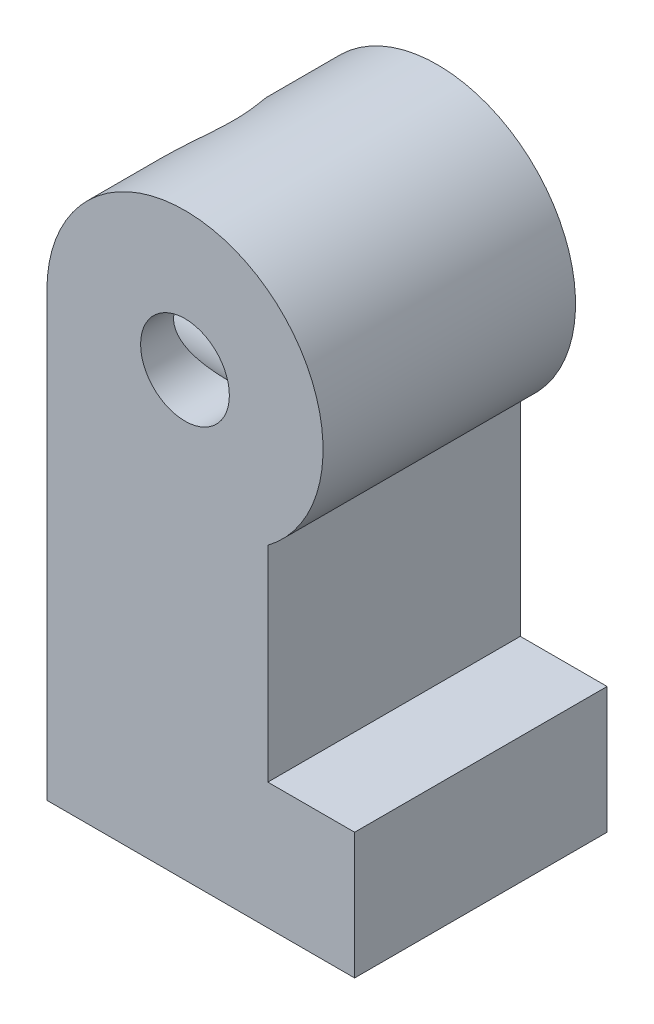
ISO-10303-21;
HEADER;
FILE_DESCRIPTION(('STEP AP214'),'2;1');
FILE_NAME('part.step','',(''),(''),'','','');
FILE_SCHEMA(('AUTOMOTIVE_DESIGN { 1 0 10303 214 1 1 1 1 }'));
ENDSEC;
DATA;
#1=APPLICATION_CONTEXT('core data for automotive mechanical design processes');
#2=APPLICATION_PROTOCOL_DEFINITION('international standard','automotive_design',2000,#1);
#3=PRODUCT_CONTEXT('',#1,'mechanical');
#4=PRODUCT('Part','Part','',(#3));
#5=PRODUCT_RELATED_PRODUCT_CATEGORY('part','',(#4));
#6=PRODUCT_DEFINITION_FORMATION('','',#4);
#7=PRODUCT_DEFINITION_CONTEXT('part definition',#1,'design');
#8=PRODUCT_DEFINITION('design','',#6,#7);
#9=PRODUCT_DEFINITION_SHAPE('','',#8);
#10=(LENGTH_UNIT() NAMED_UNIT(*) SI_UNIT(.MILLI.,.METRE.));
#11=(NAMED_UNIT(*) PLANE_ANGLE_UNIT() SI_UNIT($,.RADIAN.));
#12=(NAMED_UNIT(*) SI_UNIT($,.STERADIAN.) SOLID_ANGLE_UNIT());
#13=UNCERTAINTY_MEASURE_WITH_UNIT(LENGTH_MEASURE(1.E-05),#10,'distance_accuracy_value','');
#14=(GEOMETRIC_REPRESENTATION_CONTEXT(3) GLOBAL_UNCERTAINTY_ASSIGNED_CONTEXT((#13)) GLOBAL_UNIT_ASSIGNED_CONTEXT((#10,
#11,#12)) REPRESENTATION_CONTEXT('',''));
#15=CARTESIAN_POINT('',(0.,0.,0.));
#16=DIRECTION('',(0.,0.,1.));
#17=DIRECTION('',(1.,0.,0.));
#18=AXIS2_PLACEMENT_3D('',#15,#16,#17);
#19=CARTESIAN_POINT('',(0.,0.,3.2));
#20=DIRECTION('',(0.,0.,-1.));
#21=DIRECTION('',(-1.,0.,0.));
#22=AXIS2_PLACEMENT_3D('',#19,#20,#21);
#23=CYLINDRICAL_SURFACE('',#22,1.125);
#24=CARTESIAN_POINT('',(-1.125,0.,2.3473389188611));
#25=CARTESIAN_POINT('',(-1.12499601220494,-0.0635224394016925,2.33380410602163));
#26=CARTESIAN_POINT('',(-1.11959132494664,-0.126549212922416,2.31765742562919));
#27=CARTESIAN_POINT('',(-1.09874390966938,-0.249600832497359,2.28084354065195));
#28=CARTESIAN_POINT('',(-1.08328080509446,-0.309619317884162,2.2601672163323));
#29=CARTESIAN_POINT('',(-1.04347399628676,-0.424828872467446,2.21551034200095));
#30=CARTESIAN_POINT('',(-1.01918406757623,-0.480046716159964,2.19155033632218));
#31=CARTESIAN_POINT('',(-0.962692007757892,-0.585160880286582,2.14145296258323));
#32=CARTESIAN_POINT('',(-0.93048842708919,-0.635056223382687,2.11531519619826));
#33=CARTESIAN_POINT('',(-0.855043059532689,-0.734038070956846,2.05930168968676));
#34=CARTESIAN_POINT('',(-0.810981194410659,-0.782444986465048,2.02932882184068));
#35=CARTESIAN_POINT('',(-0.714751811530277,-0.871229346736284,1.9704227391338));
#36=CARTESIAN_POINT('',(-0.662583608240194,-0.911606111751575,1.94148961245621));
#37=CARTESIAN_POINT('',(-0.560553620351539,-0.976931449596659,1.89210040798983));
#38=CARTESIAN_POINT('',(-0.511920232726052,-1.00334600628982,1.87105058528707));
#39=CARTESIAN_POINT('',(-0.409898900714721,-1.04915235560954,1.83330546508652));
#40=CARTESIAN_POINT('',(-0.356519689306091,-1.06855672780248,1.81660238271409));
#41=CARTESIAN_POINT('',(-0.255688273838734,-1.09657707588453,1.79199009466162));
#42=CARTESIAN_POINT('',(-0.208854174591178,-1.10649312182993,1.78304880822915));
#43=CARTESIAN_POINT('',(-0.113607868283373,-1.12027993373593,1.77053187067493));
#44=CARTESIAN_POINT('',(-0.0651971314711267,-1.12415617597144,1.76695135906744));
#45=CARTESIAN_POINT('',(0.0318951164141843,-1.12559736259209,1.7656258787011));
#46=CARTESIAN_POINT('',(0.0805769707012727,-1.12315004002763,1.76789225217767));
#47=CARTESIAN_POINT('',(0.176650195127621,-1.1120980870853,1.77797429241531));
#48=CARTESIAN_POINT('',(0.224040733843313,-1.10348958268713,1.78579345062547));
#49=CARTESIAN_POINT('',(0.315792323208193,-1.08079074424583,1.80591351695063));
#50=CARTESIAN_POINT('',(0.360183988009273,-1.06677074342543,1.81815679945743));
#51=CARTESIAN_POINT('',(0.445984979510318,-1.03384621377959,1.84601766252827));
#52=CARTESIAN_POINT('',(0.487392080705541,-1.01493808723141,1.8616377270542));
#53=CARTESIAN_POINT('',(0.586599865912948,-0.962317132004969,1.90348152483538));
#54=CARTESIAN_POINT('',(0.642378688916696,-0.925907494659782,1.93112856281814));
#55=CARTESIAN_POINT('',(0.746095583744675,-0.844583744889322,1.98861356265343));
#56=CARTESIAN_POINT('',(0.794020432403516,-0.799655559157647,2.01845509932831));
#57=CARTESIAN_POINT('',(0.881881474375551,-0.701628278219067,2.07832162046633));
#58=CARTESIAN_POINT('',(0.921729872000756,-0.648449443628671,2.10834530791607));
#59=CARTESIAN_POINT('',(0.991845060840207,-0.535075368312611,2.16625635870807));
#60=CARTESIAN_POINT('',(1.02211661777415,-0.47488363788133,2.19414477936842));
#61=CARTESIAN_POINT('',(1.07220537898772,-0.347500994167197,2.24645375260998));
#62=CARTESIAN_POINT('',(1.09184102179963,-0.280210621641525,2.2708091772563));
#63=CARTESIAN_POINT('',(1.11830129387536,-0.141418348366685,2.31383596961299));
#64=CARTESIAN_POINT('',(1.12514078209549,-0.069921431954022,2.33251390890241));
#65=CARTESIAN_POINT('',(1.12487419937618,0.0645909919671675,2.36103577030789));
#66=CARTESIAN_POINT('',(1.11954630491613,0.127430194514606,2.37173815491701));
#67=CARTESIAN_POINT('',(1.09823833796243,0.251952573435595,2.38797131722881));
#68=CARTESIAN_POINT('',(1.08226344227078,0.313636296650123,2.39350460511933));
#69=CARTESIAN_POINT('',(1.04186917954401,0.428381245080361,2.39956020324518));
#70=CARTESIAN_POINT('',(1.01830383740582,0.481726035358663,2.40047602490607));
#71=CARTESIAN_POINT('',(0.963241592460272,0.58409651525199,2.39907264064777));
#72=CARTESIAN_POINT('',(0.93174411250854,0.633121890234734,2.39675319927425));
#73=CARTESIAN_POINT('',(0.860808847831994,0.726751619637444,2.38973742781581));
#74=CARTESIAN_POINT('',(0.82119562079092,0.771218432870854,2.38498432298786));
#75=CARTESIAN_POINT('',(0.735549334158844,0.853295385717144,2.37421545143315));
#76=CARTESIAN_POINT('',(0.689514084025955,0.890903175585667,2.36819925351225));
#77=CARTESIAN_POINT('',(0.589233460463158,0.960398181339222,2.35570701633602));
#78=CARTESIAN_POINT('',(0.534664337344831,0.991818425018867,2.34922475312853));
#79=CARTESIAN_POINT('',(0.420947467673174,1.04516613018686,2.337422559599));
#80=CARTESIAN_POINT('',(0.361799817892581,1.06709379224793,2.33210260471924));
#81=CARTESIAN_POINT('',(0.240144994687219,1.10089203950986,2.3236260336266));
#82=CARTESIAN_POINT('',(0.177619579951596,1.11270065973476,2.32048276876123));
#83=CARTESIAN_POINT('',(0.0514026269180644,1.12561317651157,2.31703583949103));
#84=CARTESIAN_POINT('',(-0.0122886330395961,1.12671959561246,2.31673150594003));
#85=CARTESIAN_POINT('',(-0.136846225401287,1.11833337834389,2.31898238684073));
#86=CARTESIAN_POINT('',(-0.197737514903278,1.10918061955866,2.32144591082964));
#87=CARTESIAN_POINT('',(-0.317092536763579,1.08112758209993,2.32862574389176));
#88=CARTESIAN_POINT('',(-0.375555930246,1.06222594762577,2.3333423663023));
#89=CARTESIAN_POINT('',(-0.489031036023153,1.01502938088974,2.34421265125779));
#90=CARTESIAN_POINT('',(-0.544006889052981,0.986651322218796,2.35037888270572));
#91=CARTESIAN_POINT('',(-0.648564957935641,0.921298464922231,2.3629667637851));
#92=CARTESIAN_POINT('',(-0.698146014087716,0.884321823227384,2.36938846793105));
#93=CARTESIAN_POINT('',(-0.792049197139993,0.801448495023469,2.38137151256474));
#94=CARTESIAN_POINT('',(-0.836169878729182,0.755318256720698,2.3869014056677));
#95=CARTESIAN_POINT('',(-0.916082363289536,0.656103749837208,2.39543400008034));
#96=CARTESIAN_POINT('',(-0.951874490212227,0.603019751858889,2.39843679969698));
#97=CARTESIAN_POINT('',(-1.01310943085238,0.493037399677432,2.40060221734877));
#98=CARTESIAN_POINT('',(-1.03881244804715,0.436286234814305,2.39986933949241));
#99=CARTESIAN_POINT('',(-1.08042458535055,0.319580441437188,2.39391820098744));
#100=CARTESIAN_POINT('',(-1.09634979715911,0.259631253753111,2.38870734402285));
#101=CARTESIAN_POINT('',(-1.11318425741354,0.166074578890811,2.37689171462176));
#102=CARTESIAN_POINT('',(-1.11762785686126,0.132841986110212,2.37198891838182));
#103=CARTESIAN_POINT('',(-1.12353657837511,0.0663613633497973,2.36074018061545));
#104=CARTESIAN_POINT('',(-1.12500207878032,0.0331133358676711,2.35439442251746));
#105=CARTESIAN_POINT('',(-1.125,0.,2.3473389188611));
#106=B_SPLINE_CURVE_WITH_KNOTS('',3,(#24,#25,#26,#27,#28,#29,#30,#31,#32,#33,#34,#35,#36,#37,
#38,#39,#40,#41,#42,#43,#44,#45,#46,#47,#48,#49,#50,#51,#52,#53,#54,#55,#56,#57,#58,#59,#60,#61,
#62,#63,#64,#65,#66,#67,#68,#69,#70,#71,#72,#73,#74,#75,#76,#77,#78,#79,#80,#81,#82,#83,#84,#85,
#86,#87,#88,#89,#90,#91,#92,#93,#94,#95,#96,#97,#98,#99,#100,#101,#102,#103,#104,#105),
.UNSPECIFIED.,.T.,.F.,(4,2,2,2,2,2,2,2,2,2,2,2,2,2,2,2,2,2,2,2,2,2,2,2,2,2,2,2,2,2,2,2,2,2,2,2,
2,2,2,2,4),(0.,0.194704281815476,0.389804233313693,0.583734978458754,0.777701272834722,
0.99278695950388,1.20789084531384,1.3848913370292,1.56157261020517,1.70705132882171,
1.85239806533272,1.9980269684926,2.14374752055163,2.28763466628538,2.43162801780203,
2.64684483394785,2.86242035298069,3.08022658115349,3.29792425138072,3.5192295774167,
3.74027776276115,3.93111548331707,4.12186048207796,4.29603714981357,4.4702264943513,
4.64867833784131,4.82719120048586,5.0162107505443,5.20522630653464,5.39539121189372,
5.58551129357834,5.76951429100895,5.95354288510192,6.13923013043181,6.32495721376973,
6.51623476710657,6.70750487917423,6.89345415453825,7.07909658015413,7.18060602411877,
7.28210257147048),.UNSPECIFIED.);
#107=CARTESIAN_POINT('',(-1.125,0.,2.3473389188611));
#108=VERTEX_POINT('',#107);
#109=EDGE_CURVE('E43',#108,#108,#106,.T.);
#110=ORIENTED_EDGE('',*,*,#109,.F.);
#111=EDGE_LOOP('',(#110));
#112=FACE_BOUND('',#111,.T.);
#113=CARTESIAN_POINT('',(0.,0.,3.2));
#114=DIRECTION('',(0.,0.,1.));
#115=DIRECTION('',(1.,0.,0.));
#116=AXIS2_PLACEMENT_3D('',#113,#114,#115);
#117=CIRCLE('',#116,1.125);
#118=CARTESIAN_POINT('',(1.125,0.,3.2));
#119=VERTEX_POINT('',#118);
#120=EDGE_CURVE('E172',#119,#119,#117,.T.);
#121=ORIENTED_EDGE('',*,*,#120,.T.);
#122=EDGE_LOOP('',(#121));
#123=FACE_BOUND('',#122,.T.);
#124=ADVANCED_FACE('F38',(#112,#123),#23,.F.);
#125=CARTESIAN_POINT('',(0.,0.,3.2));
#126=DIRECTION('',(0.,0.,1.));
#127=DIRECTION('',(1.,0.,0.));
#128=AXIS2_PLACEMENT_3D('',#125,#126,#127);
#129=PLANE('',#128);
#130=CARTESIAN_POINT('',(0.,0.,3.2));
#131=DIRECTION('',(0.,0.,1.));
#132=DIRECTION('',(1.,0.,0.));
#133=AXIS2_PLACEMENT_3D('',#130,#131,#132);
#134=CIRCLE('',#133,3.5);
#135=CARTESIAN_POINT('',(2.1,-2.8,3.2));
#136=VERTEX_POINT('',#135);
#137=CARTESIAN_POINT('',(-3.5,0.,3.2));
#138=VERTEX_POINT('',#137);
#139=EDGE_CURVE('E146',#136,#138,#134,.T.);
#140=ORIENTED_EDGE('',*,*,#139,.T.);
#141=DIRECTION('',(0.,-1.,0.));
#142=VECTOR('',#141,1.);
#143=CARTESIAN_POINT('',(-3.5,0.,3.2));
#144=LINE('',#143,#142);
#145=CARTESIAN_POINT('',(-3.5,-11.2,3.2));
#146=VERTEX_POINT('',#145);
#147=EDGE_CURVE('E139',#138,#146,#144,.T.);
#148=ORIENTED_EDGE('',*,*,#147,.T.);
#149=DIRECTION('',(1.,0.,0.));
#150=VECTOR('',#149,1.);
#151=CARTESIAN_POINT('',(-3.5,-11.2,3.2));
#152=LINE('',#151,#150);
#153=CARTESIAN_POINT('',(4.3,-11.2,3.2));
#154=VERTEX_POINT('',#153);
#155=EDGE_CURVE('E145',#146,#154,#152,.T.);
#156=ORIENTED_EDGE('',*,*,#155,.T.);
#157=DIRECTION('',(0.,1.,0.));
#158=VECTOR('',#157,1.);
#159=CARTESIAN_POINT('',(4.3,-11.2,3.2));
#160=LINE('',#159,#158);
#161=CARTESIAN_POINT('',(4.3,-8.,3.2));
#162=VERTEX_POINT('',#161);
#163=EDGE_CURVE('E163',#154,#162,#160,.T.);
#164=ORIENTED_EDGE('',*,*,#163,.T.);
#165=DIRECTION('',(-1.,0.,0.));
#166=VECTOR('',#165,1.);
#167=CARTESIAN_POINT('',(4.3,-8.,3.2));
#168=LINE('',#167,#166);
#169=CARTESIAN_POINT('',(2.1,-8.,3.2));
#170=VERTEX_POINT('',#169);
#171=EDGE_CURVE('E165',#162,#170,#168,.T.);
#172=ORIENTED_EDGE('',*,*,#171,.T.);
#173=DIRECTION('',(0.,1.,0.));
#174=VECTOR('',#173,1.);
#175=CARTESIAN_POINT('',(2.1,-8.,3.2));
#176=LINE('',#175,#174);
#177=EDGE_CURVE('E151',#170,#136,#176,.T.);
#178=ORIENTED_EDGE('',*,*,#177,.T.);
#179=EDGE_LOOP('',(#140,#148,#156,#164,#172,#178));
#180=FACE_BOUND('',#179,.T.);
#181=ORIENTED_EDGE('',*,*,#120,.F.);
#182=EDGE_LOOP('',(#181));
#183=FACE_BOUND('',#182,.T.);
#184=ADVANCED_FACE('F148',(#180,#183),#129,.T.);
#185=CARTESIAN_POINT('',(0.,0.,-3.2));
#186=DIRECTION('',(0.,0.,1.));
#187=DIRECTION('',(1.,0.,0.));
#188=AXIS2_PLACEMENT_3D('',#185,#186,#187);
#189=PLANE('',#188);
#190=CARTESIAN_POINT('',(0.,0.,-3.2));
#191=DIRECTION('',(0.,0.,1.));
#192=DIRECTION('',(1.,0.,0.));
#193=AXIS2_PLACEMENT_3D('',#190,#191,#192);
#194=CIRCLE('',#193,3.5);
#195=CARTESIAN_POINT('',(2.1,-2.8,-3.2));
#196=VERTEX_POINT('',#195);
#197=CARTESIAN_POINT('',(-3.5,0.,-3.2));
#198=VERTEX_POINT('',#197);
#199=EDGE_CURVE('E169',#196,#198,#194,.T.);
#200=ORIENTED_EDGE('',*,*,#199,.F.);
#201=DIRECTION('',(0.,1.,0.));
#202=VECTOR('',#201,1.);
#203=CARTESIAN_POINT('',(2.1,-8.,-3.2));
#204=LINE('',#203,#202);
#205=CARTESIAN_POINT('',(2.1,-8.,-3.2));
#206=VERTEX_POINT('',#205);
#207=EDGE_CURVE('E154',#206,#196,#204,.T.);
#208=ORIENTED_EDGE('',*,*,#207,.F.);
#209=DIRECTION('',(-1.,0.,0.));
#210=VECTOR('',#209,1.);
#211=CARTESIAN_POINT('',(4.3,-8.,-3.2));
#212=LINE('',#211,#210);
#213=CARTESIAN_POINT('',(4.3,-8.,-3.2));
#214=VERTEX_POINT('',#213);
#215=EDGE_CURVE('E156',#214,#206,#212,.T.);
#216=ORIENTED_EDGE('',*,*,#215,.F.);
#217=DIRECTION('',(0.,1.,0.));
#218=VECTOR('',#217,1.);
#219=CARTESIAN_POINT('',(4.3,-11.2,-3.2));
#220=LINE('',#219,#218);
#221=CARTESIAN_POINT('',(4.3,-11.2,-3.2));
#222=VERTEX_POINT('',#221);
#223=EDGE_CURVE('E176',#222,#214,#220,.T.);
#224=ORIENTED_EDGE('',*,*,#223,.F.);
#225=DIRECTION('',(1.,0.,0.));
#226=VECTOR('',#225,1.);
#227=CARTESIAN_POINT('',(-3.5,-11.2,-3.2));
#228=LINE('',#227,#226);
#229=CARTESIAN_POINT('',(-3.5,-11.2,-3.2));
#230=VERTEX_POINT('',#229);
#231=EDGE_CURVE('E174',#230,#222,#228,.T.);
#232=ORIENTED_EDGE('',*,*,#231,.F.);
#233=DIRECTION('',(0.,-1.,0.));
#234=VECTOR('',#233,1.);
#235=CARTESIAN_POINT('',(-3.5,0.,-3.2));
#236=LINE('',#235,#234);
#237=EDGE_CURVE('E171',#198,#230,#236,.T.);
#238=ORIENTED_EDGE('',*,*,#237,.F.);
#239=EDGE_LOOP('',(#200,#208,#216,#224,#232,#238));
#240=FACE_BOUND('',#239,.T.);
#241=CARTESIAN_POINT('',(0.,0.,-3.2));
#242=DIRECTION('',(0.,0.,1.));
#243=DIRECTION('',(1.,0.,0.));
#244=AXIS2_PLACEMENT_3D('',#241,#242,#243);
#245=CIRCLE('',#244,1.125);
#246=CARTESIAN_POINT('',(1.125,0.,-3.2));
#247=VERTEX_POINT('',#246);
#248=EDGE_CURVE('E159',#247,#247,#245,.T.);
#249=ORIENTED_EDGE('',*,*,#248,.T.);
#250=EDGE_LOOP('',(#249));
#251=FACE_BOUND('',#250,.T.);
#252=ADVANCED_FACE('F249',(#240,#251),#189,.F.);
#253=CARTESIAN_POINT('',(0.,0.,3.2));
#254=DIRECTION('',(0.,0.,-1.));
#255=DIRECTION('',(-1.,0.,0.));
#256=AXIS2_PLACEMENT_3D('',#253,#254,#255);
#257=CYLINDRICAL_SURFACE('',#256,3.5);
#258=DIRECTION('',(0.,0.,-1.));
#259=VECTOR('',#258,1.);
#260=CARTESIAN_POINT('',(-3.5,0.,3.2));
#261=LINE('',#260,#259);
#262=CARTESIAN_POINT('',(-3.5,0.,-2.3473389188611));
#263=VERTEX_POINT('',#262);
#264=EDGE_CURVE('E53',#263,#198,#261,.T.);
#265=ORIENTED_EDGE('',*,*,#264,.F.);
#266=CARTESIAN_POINT('',(-3.5,0.,-2.3473389188611));
#267=CARTESIAN_POINT('',(-3.50001181867057,0.0571477217374244,-2.35952324799212));
#268=CARTESIAN_POINT('',(-3.49860061614223,0.114743770065322,-2.36959863933398));
#269=CARTESIAN_POINT('',(-3.49288728833139,0.230360407827149,-2.38551560428378));
#270=CARTESIAN_POINT('',(-3.48858592151156,0.288380881929227,-2.39135828784083));
#271=CARTESIAN_POINT('',(-3.47707880110764,0.404089359673819,-2.3987800738924));
#272=CARTESIAN_POINT('',(-3.46988896332483,0.461777456069779,-2.40038218120076));
#273=CARTESIAN_POINT('',(-3.45265487837301,0.576676567862824,-2.39946378384657));
#274=CARTESIAN_POINT('',(-3.44261062074615,0.633887581511211,-2.39694326407962));
#275=CARTESIAN_POINT('',(-3.4083356117771,0.804105036209102,-2.38336595556229));
#276=CARTESIAN_POINT('',(-3.37994514796453,0.915869866292524,-2.36630384227635));
#277=CARTESIAN_POINT('',(-3.31344895138059,1.13314832429677,-2.3176646602164));
#278=CARTESIAN_POINT('',(-3.27533300607753,1.23865523648251,-2.28607230536925));
#279=CARTESIAN_POINT('',(-3.18884504357403,1.44731564674367,-2.20809491628295));
#280=CARTESIAN_POINT('',(-3.14001706082533,1.55000373794561,-2.16097838899282));
#281=CARTESIAN_POINT('',(-3.03584021966201,1.74526360748642,-2.05467670041225));
#282=CARTESIAN_POINT('',(-2.98048864139242,1.83783113507598,-1.99548649772665));
#283=CARTESIAN_POINT('',(-2.85379750966277,2.03018562272158,-1.8535357377681));
#284=CARTESIAN_POINT('',(-2.78149734246403,2.12760502281981,-1.76842986956987));
#285=CARTESIAN_POINT('',(-2.63462775579363,2.30698502977076,-1.58471660055204));
#286=CARTESIAN_POINT('',(-2.56005548720432,2.38892521486053,-1.48609165576466));
#287=CARTESIAN_POINT('',(-2.41871956278776,2.53162908276111,-1.28326463330636));
#288=CARTESIAN_POINT('',(-2.3517770338946,2.59348192527748,-1.17995301376685));
#289=CARTESIAN_POINT('',(-2.22572729179699,2.70240840583051,-0.96138451080996));
#290=CARTESIAN_POINT('',(-2.16660339102304,2.74951382379002,-0.846154035362333));
#291=CARTESIAN_POINT('',(-2.08383834027692,2.81234304649958,-0.647727577127011));
#292=CARTESIAN_POINT('',(-2.05514190190293,2.83323788763357,-0.568318674724289));
#293=CARTESIAN_POINT('',(-2.0077106103014,2.86704539023274,-0.404993818729678));
#294=CARTESIAN_POINT('',(-1.98895375460871,2.87997569256307,-0.321088276567454));
#295=CARTESIAN_POINT('',(-1.9642337035912,2.89690144617537,-0.14949120839477));
#296=CARTESIAN_POINT('',(-1.95840842288825,2.9008005995437,-0.0617689490361575));
#297=CARTESIAN_POINT('',(-1.96118525247281,2.89892227463506,0.113347387177274));
#298=CARTESIAN_POINT('',(-1.96979151536346,2.89314201115589,0.200741362317401));
#299=CARTESIAN_POINT('',(-2.00106904761721,2.8716013071517,0.380024269842342));
#300=CARTESIAN_POINT('',(-2.02496702821199,2.85496763238069,0.47158184271351));
#301=CARTESIAN_POINT('',(-2.08366151371945,2.81241019263363,0.648946825699926));
#302=CARTESIAN_POINT('',(-2.11849009267811,2.78645905439294,0.734736399221446));
#303=CARTESIAN_POINT('',(-2.18679788954713,2.73301571417905,0.882269209875889));
#304=CARTESIAN_POINT('',(-2.21895300854012,2.70705840232988,0.945212765686844));
#305=CARTESIAN_POINT('',(-2.28610481874926,2.6505953738598,1.06746047311733));
#306=CARTESIAN_POINT('',(-2.3211031371119,2.62008704424715,1.12676250614175));
#307=CARTESIAN_POINT('',(-2.42868720689749,2.52207206221611,1.29954031385502));
#308=CARTESIAN_POINT('',(-2.50382746204864,2.44810107186269,1.40781900138491));
#309=CARTESIAN_POINT('',(-2.65861963929727,2.2793913271792,1.61639176669799));
#310=CARTESIAN_POINT('',(-2.73829291655651,2.18373583955496,1.71592187098404));
#311=CARTESIAN_POINT('',(-2.89271972414267,1.97459276266237,1.89862659550263));
#312=CARTESIAN_POINT('',(-2.96748036225121,1.86113177857625,1.98182520751841));
#313=CARTESIAN_POINT('',(-3.09615262794246,1.63641660452186,2.11729235303731));
#314=CARTESIAN_POINT('',(-3.15148910825451,1.52768128659245,2.17237560238323));
#315=CARTESIAN_POINT('',(-3.25238946581503,1.29903752936262,2.26644162806675));
#316=CARTESIAN_POINT('',(-3.29795623061859,1.17913240650188,2.30542916484462));
#317=CARTESIAN_POINT('',(-3.35700281785587,0.9924122450753,2.34982914548171));
#318=CARTESIAN_POINT('',(-3.37520301505509,0.928685601014816,2.36230923884271));
#319=CARTESIAN_POINT('',(-3.40809707788925,0.799562026687027,2.38212491102286));
#320=CARTESIAN_POINT('',(-3.42279285501696,0.734166028622345,2.38946329864895));
#321=CARTESIAN_POINT('',(-3.44842924317227,0.602361890112993,2.3987251857968));
#322=CARTESIAN_POINT('',(-3.45937519578144,0.535955331323914,2.40065641613778));
#323=CARTESIAN_POINT('',(-3.47740236223998,0.402723056835066,2.39895186636154));
#324=CARTESIAN_POINT('',(-3.4844861461866,0.335897649885469,2.39531979451449));
#325=CARTESIAN_POINT('',(-3.49311564200003,0.224046580330867,2.38451462581159));
#326=CARTESIAN_POINT('',(-3.49571088870466,0.178946589127796,2.37886287652598));
#327=CARTESIAN_POINT('',(-3.49915350020635,0.0891432677126903,2.3650076462582));
#328=CARTESIAN_POINT('',(-3.50000351725482,0.0444394385561706,2.35680805913186));
#329=CARTESIAN_POINT('',(-3.5,0.,2.34733891886111));
#330=B_SPLINE_CURVE_WITH_KNOTS('',3,(#266,#267,#268,#269,#270,#271,#272,#273,#274,#275,#276,
#277,#278,#279,#280,#281,#282,#283,#284,#285,#286,#287,#288,#289,#290,#291,#292,#293,#294,#295,
#296,#297,#298,#299,#300,#301,#302,#303,#304,#305,#306,#307,#308,#309,#310,#311,#312,#313,#314,
#315,#316,#317,#318,#319,#320,#321,#322,#323,#324,#325,#326,#327,#328,#329),.UNSPECIFIED.,.F.,
.F.,(4,2,2,2,2,2,2,2,2,2,2,2,2,2,2,2,2,2,2,2,2,2,2,2,2,2,2,2,2,2,2,4),(0.,0.175237440381033,
0.35042891134353,0.524668014814338,0.698907756660255,1.04686867533735,1.39519649537508,
1.76309807782818,2.13115359418281,2.57414809278723,3.01772301461145,3.42986501795747,
3.84111266440891,4.10124897819194,4.36080701764205,4.62312019539684,4.88550886538463,
5.17215450827924,5.45964925644542,5.68524281978454,5.91096641102047,6.36265437457839,
6.83912330739457,7.31488695708918,7.71498529590947,8.1149652174138,8.31702682714792,
8.51897796858323,8.720640224955,8.92216811998134,9.05864817270439,9.19492066068157),.UNSPECIFIED.);
#331=CARTESIAN_POINT('',(-3.5,0.,2.3473389188611));
#332=VERTEX_POINT('',#331);
#333=EDGE_CURVE('E60',#263,#332,#330,.T.);
#334=ORIENTED_EDGE('',*,*,#333,.T.);
#335=EDGE_CURVE('E11',#138,#332,#261,.T.);
#336=ORIENTED_EDGE('',*,*,#335,.F.);
#337=ORIENTED_EDGE('',*,*,#139,.F.);
#338=DIRECTION('',(0.,0.,-1.));
#339=VECTOR('',#338,1.);
#340=CARTESIAN_POINT('',(2.1,-2.8,3.2));
#341=LINE('',#340,#339);
#342=EDGE_CURVE('E168',#136,#196,#341,.T.);
#343=ORIENTED_EDGE('',*,*,#342,.T.);
#344=ORIENTED_EDGE('',*,*,#199,.T.);
#345=EDGE_LOOP('',(#265,#334,#336,#337,#343,#344));
#346=FACE_BOUND('',#345,.T.);
#347=ADVANCED_FACE('F40',(#346),#257,.T.);
#348=CARTESIAN_POINT('',(-3.5,0.,3.2));
#349=DIRECTION('',(1.,0.,0.));
#350=DIRECTION('',(0.,1.,0.));
#351=AXIS2_PLACEMENT_3D('',#348,#349,#350);
#352=PLANE('',#351);
#353=ORIENTED_EDGE('',*,*,#335,.T.);
#354=CARTESIAN_POINT('',(-3.5,0.499999999999998,0.));
#355=DIRECTION('',(-1.,0.,0.));
#356=DIRECTION('',(0.,-1.,0.));
#357=AXIS2_PLACEMENT_3D('',#354,#355,#356);
#358=CIRCLE('',#357,2.4);
#359=EDGE_CURVE('E126',#263,#332,#358,.T.);
#360=ORIENTED_EDGE('',*,*,#359,.F.);
#361=ORIENTED_EDGE('',*,*,#264,.T.);
#362=ORIENTED_EDGE('',*,*,#237,.T.);
#363=DIRECTION('',(0.,0.,-1.));
#364=VECTOR('',#363,1.);
#365=CARTESIAN_POINT('',(-3.5,-11.2,3.2));
#366=LINE('',#365,#364);
#367=EDGE_CURVE('E142',#146,#230,#366,.T.);
#368=ORIENTED_EDGE('',*,*,#367,.F.);
#369=ORIENTED_EDGE('',*,*,#147,.F.);
#370=EDGE_LOOP('',(#353,#360,#361,#362,#368,#369));
#371=FACE_BOUND('',#370,.T.);
#372=ADVANCED_FACE('F137',(#371),#352,.F.);
#373=CARTESIAN_POINT('',(-3.5,-11.2,3.2));
#374=DIRECTION('',(0.,1.,0.));
#375=DIRECTION('',(0.,0.,1.));
#376=AXIS2_PLACEMENT_3D('',#373,#374,#375);
#377=PLANE('',#376);
#378=DIRECTION('',(1.,0.,0.));
#379=VECTOR('',#378,1.);
#380=CARTESIAN_POINT('',(-2.1,-11.2,-2.4));
#381=LINE('',#380,#379);
#382=CARTESIAN_POINT('',(-2.1,-11.2,-2.4));
#383=VERTEX_POINT('',#382);
#384=CARTESIAN_POINT('',(1.2,-11.2,-2.4));
#385=VERTEX_POINT('',#384);
#386=EDGE_CURVE('E229',#383,#385,#381,.T.);
#387=ORIENTED_EDGE('',*,*,#386,.F.);
#388=DIRECTION('',(0.,0.,-1.));
#389=VECTOR('',#388,1.);
#390=CARTESIAN_POINT('',(-2.1,-11.2,2.4));
#391=LINE('',#390,#389);
#392=CARTESIAN_POINT('',(-2.1,-11.2,2.4));
#393=VERTEX_POINT('',#392);
#394=EDGE_CURVE('E68',#393,#383,#391,.T.);
#395=ORIENTED_EDGE('',*,*,#394,.F.);
#396=DIRECTION('',(-1.,0.,0.));
#397=VECTOR('',#396,1.);
#398=CARTESIAN_POINT('',(-2.1,-11.2,2.4));
#399=LINE('',#398,#397);
#400=CARTESIAN_POINT('',(1.2,-11.2,2.4));
#401=VERTEX_POINT('',#400);
#402=EDGE_CURVE('E218',#401,#393,#399,.T.);
#403=ORIENTED_EDGE('',*,*,#402,.F.);
#404=DIRECTION('',(0.,0.,1.));
#405=VECTOR('',#404,1.);
#406=CARTESIAN_POINT('',(1.2,-11.2,2.4));
#407=LINE('',#406,#405);
#408=EDGE_CURVE('E232',#385,#401,#407,.T.);
#409=ORIENTED_EDGE('',*,*,#408,.F.);
#410=EDGE_LOOP('',(#387,#395,#403,#409));
#411=FACE_BOUND('',#410,.T.);
#412=ORIENTED_EDGE('',*,*,#231,.T.);
#413=DIRECTION('',(0.,0.,-1.));
#414=VECTOR('',#413,1.);
#415=CARTESIAN_POINT('',(4.3,-11.2,3.2));
#416=LINE('',#415,#414);
#417=EDGE_CURVE('E186',#154,#222,#416,.T.);
#418=ORIENTED_EDGE('',*,*,#417,.F.);
#419=ORIENTED_EDGE('',*,*,#155,.F.);
#420=ORIENTED_EDGE('',*,*,#367,.T.);
#421=EDGE_LOOP('',(#412,#418,#419,#420));
#422=FACE_BOUND('',#421,.T.);
#423=ADVANCED_FACE('F322',(#411,#422),#377,.F.);
#424=CARTESIAN_POINT('',(4.3,-11.2,3.2));
#425=DIRECTION('',(-1.,0.,0.));
#426=DIRECTION('',(0.,0.,1.));
#427=AXIS2_PLACEMENT_3D('',#424,#425,#426);
#428=PLANE('',#427);
#429=ORIENTED_EDGE('',*,*,#223,.T.);
#430=DIRECTION('',(0.,0.,-1.));
#431=VECTOR('',#430,1.);
#432=CARTESIAN_POINT('',(4.3,-8.,3.2));
#433=LINE('',#432,#431);
#434=EDGE_CURVE('E183',#162,#214,#433,.T.);
#435=ORIENTED_EDGE('',*,*,#434,.F.);
#436=ORIENTED_EDGE('',*,*,#163,.F.);
#437=ORIENTED_EDGE('',*,*,#417,.T.);
#438=EDGE_LOOP('',(#429,#435,#436,#437));
#439=FACE_BOUND('',#438,.T.);
#440=ADVANCED_FACE('F327',(#439),#428,.F.);
#441=CARTESIAN_POINT('',(4.3,-8.,3.2));
#442=DIRECTION('',(0.,-1.,0.));
#443=DIRECTION('',(0.,0.,-1.));
#444=AXIS2_PLACEMENT_3D('',#441,#442,#443);
#445=PLANE('',#444);
#446=ORIENTED_EDGE('',*,*,#215,.T.);
#447=DIRECTION('',(0.,0.,-1.));
#448=VECTOR('',#447,1.);
#449=CARTESIAN_POINT('',(2.1,-8.,3.2));
#450=LINE('',#449,#448);
#451=EDGE_CURVE('E180',#170,#206,#450,.T.);
#452=ORIENTED_EDGE('',*,*,#451,.F.);
#453=ORIENTED_EDGE('',*,*,#171,.F.);
#454=ORIENTED_EDGE('',*,*,#434,.T.);
#455=EDGE_LOOP('',(#446,#452,#453,#454));
#456=FACE_BOUND('',#455,.T.);
#457=ADVANCED_FACE('F260',(#456),#445,.F.);
#458=CARTESIAN_POINT('',(2.1,-8.,3.2));
#459=DIRECTION('',(-1.,0.,0.));
#460=DIRECTION('',(0.,-1.,0.));
#461=AXIS2_PLACEMENT_3D('',#458,#459,#460);
#462=PLANE('',#461);
#463=ORIENTED_EDGE('',*,*,#207,.T.);
#464=ORIENTED_EDGE('',*,*,#342,.F.);
#465=ORIENTED_EDGE('',*,*,#177,.F.);
#466=ORIENTED_EDGE('',*,*,#451,.T.);
#467=EDGE_LOOP('',(#463,#464,#465,#466));
#468=FACE_BOUND('',#467,.T.);
#469=ADVANCED_FACE('F253',(#468),#462,.F.);
#470=CARTESIAN_POINT('',(-1.125,0.,-2.3473389188611));
#471=CARTESIAN_POINT('',(-1.12499737112551,0.0571559115537202,-2.35951135938902));
#472=CARTESIAN_POINT('',(-1.12062528062339,0.114792972964668,-2.36958869246858));
#473=CARTESIAN_POINT('',(-1.10290654730504,0.229309067057894,-2.38538742450183));
#474=CARTESIAN_POINT('',(-1.08955461388651,0.286187632703299,-2.39110625133999));
#475=CARTESIAN_POINT('',(-1.05409738639177,0.397373706075356,-2.39845182567771));
#476=CARTESIAN_POINT('',(-1.03199852308556,0.451683069920674,-2.40008157303534));
#477=CARTESIAN_POINT('',(-0.979638122492714,0.556194902233513,-2.39991196236726));
#478=CARTESIAN_POINT('',(-0.949375552973461,0.606396850305657,-2.39811217053028));
#479=CARTESIAN_POINT('',(-0.881063150607268,0.702035342461935,-2.39196821304421));
#480=CARTESIAN_POINT('',(-0.842913156752915,0.747397922317172,-2.38758982997534));
#481=CARTESIAN_POINT('',(-0.760072172711924,0.831506139049307,-2.37737292854629));
#482=CARTESIAN_POINT('',(-0.715379198027917,0.870249760631708,-2.37153396680798));
#483=CARTESIAN_POINT('',(-0.617647115581621,0.942359754558981,-2.35918169614027));
#484=CARTESIAN_POINT('',(-0.564267762034211,0.975262759862685,-2.35264895002708));
#485=CARTESIAN_POINT('',(-0.452700650763429,1.03179360391853,-2.34052028638809));
#486=CARTESIAN_POINT('',(-0.394512689647921,1.05542105009429,-2.3349244085198));
#487=CARTESIAN_POINT('',(-0.27411803587916,1.09293495004078,-2.32568484925689));
#488=CARTESIAN_POINT('',(-0.211870540159263,1.10669731195706,-2.32206616882398));
#489=CARTESIAN_POINT('',(-0.0858551786793551,1.12351778917156,-2.31760739765646));
#490=CARTESIAN_POINT('',(-0.022087714163505,1.12657869863032,-2.31676658162168));
#491=CARTESIAN_POINT('',(0.102953148258301,1.12196859238611,-2.31800739579004));
#492=CARTESIAN_POINT('',(0.164240510906769,1.11464144927822,-2.31999539252719));
#493=CARTESIAN_POINT('',(0.284678764195499,1.09011964542003,-2.32635271297094));
#494=CARTESIAN_POINT('',(0.343829414172173,1.07292387680111,-2.33072230403659));
#495=CARTESIAN_POINT('',(0.45864183931076,1.02910846258999,-2.34105730361621));
#496=CARTESIAN_POINT('',(0.514288848418304,1.00245171522281,-2.34702897193378));
#497=CARTESIAN_POINT('',(0.620460283850815,0.94044416658034,-2.35945032312253));
#498=CARTESIAN_POINT('',(0.670983409502157,0.905091165564758,-2.36590012665043));
#499=CARTESIAN_POINT('',(0.76715794789903,0.825299888660927,-2.3782046667348));
#500=CARTESIAN_POINT('',(0.812602882582818,0.780608057106066,-2.38403389984714));
#501=CARTESIAN_POINT('',(0.895398599356697,0.684052633516888,-2.393422583022));
#502=CARTESIAN_POINT('',(0.932750958153871,0.632190441742364,-2.39698247549173));
#503=CARTESIAN_POINT('',(0.997471143410428,0.523986296012226,-2.40047627238326));
#504=CARTESIAN_POINT('',(1.02503995888226,0.467767518503711,-2.4004879793136));
#505=CARTESIAN_POINT('',(1.07042729800353,0.351693877480555,-2.39611559247979));
#506=CARTESIAN_POINT('',(1.08825075035882,0.291840869023524,-2.39173372394487));
#507=CARTESIAN_POINT('',(1.11296022724753,0.174188681044095,-2.37847470662232));
#508=CARTESIAN_POINT('',(1.1204355282016,0.1164801148725,-2.36988145022694));
#509=CARTESIAN_POINT('',(1.12647364147145,0.001414684936495,-2.3483693290168));
#510=CARTESIAN_POINT('',(1.12503605421965,-0.0559421629448897,-2.33545027029953));
#511=CARTESIAN_POINT('',(1.11370256904392,-0.168889798198077,-2.30564730512098));
#512=CARTESIAN_POINT('',(1.10378492292239,-0.224475663120938,-2.28875328518053));
#513=CARTESIAN_POINT('',(1.07618124384277,-0.332523002741639,-2.251704308161));
#514=CARTESIAN_POINT('',(1.05849326812398,-0.384983692346522,-2.23154853636564));
#515=CARTESIAN_POINT('',(1.01399987845139,-0.490974235042071,-2.18668772246466));
#516=CARTESIAN_POINT('',(0.986460140029802,-0.544087308064206,-2.16172936132338));
#517=CARTESIAN_POINT('',(0.923799843474256,-0.644780559253155,-2.11013878665907));
#518=CARTESIAN_POINT('',(0.888671211040759,-0.692354760652622,-2.08350481190544));
#519=CARTESIAN_POINT('',(0.806283107670254,-0.787406830769059,-2.02634077843825));
#520=CARTESIAN_POINT('',(0.758025065950741,-0.833999103106267,-1.99577156878634));
#521=CARTESIAN_POINT('',(0.653228427309242,-0.918388862791694,-1.93670354120421));
#522=CARTESIAN_POINT('',(0.596695247221075,-0.95619206180846,-1.90820338700714));
#523=CARTESIAN_POINT('',(0.490640568402289,-1.01370220703531,-1.86271531566984));
#524=CARTESIAN_POINT('',(0.442773661827755,-1.03557399308324,-1.84461516096286));
#525=CARTESIAN_POINT('',(0.343109652775187,-1.07271617549312,-1.81305243233884));
#526=CARTESIAN_POINT('',(0.291318033389387,-1.08799558901392,-1.7995835288744));
#527=CARTESIAN_POINT('',(0.184264015303251,-1.11116831790049,-1.77887291048872));
#528=CARTESIAN_POINT('',(0.128971556804112,-1.11898455786042,-1.77169623881071));
#529=CARTESIAN_POINT('',(0.0173933077404045,-1.12624980440841,-1.76503303031996));
#530=CARTESIAN_POINT('',(-0.0388914981349428,-1.12570668527815,-1.76553925642684));
#531=CARTESIAN_POINT('',(-0.14178400273362,-1.11704225697563,-1.77346956391895));
#532=CARTESIAN_POINT('',(-0.188579747290347,-1.11006678546861,-1.77984741812));
#533=CARTESIAN_POINT('',(-0.280105201758512,-1.09057730736619,-1.79728514710262));
#534=CARTESIAN_POINT('',(-0.324832957956835,-1.07805817694226,-1.80834935291835));
#535=CARTESIAN_POINT('',(-0.426074638216689,-1.04299747990461,-1.83843733788625));
#536=CARTESIAN_POINT('',(-0.481483502520854,-1.01850036976908,-1.8588868686552));
#537=CARTESIAN_POINT('',(-0.586489860860374,-0.961886695238636,-1.90373096226474));
#538=CARTESIAN_POINT('',(-0.63607899958332,-0.929759371442185,-1.928131080242));
#539=CARTESIAN_POINT('',(-0.729933626712194,-0.858119424717697,-1.97926350824986));
#540=CARTESIAN_POINT('',(-0.774083974285832,-0.818481445255483,-2.00603054921127));
#541=CARTESIAN_POINT('',(-0.855599549993512,-0.732850760081086,-2.05976629523262));
#542=CARTESIAN_POINT('',(-0.892961784620465,-0.686855266419821,-2.0867350838298));
#543=CARTESIAN_POINT('',(-0.965981538225072,-0.580792127345768,-2.14385140041475));
#544=CARTESIAN_POINT('',(-1.00028993111993,-0.519659348424756,-2.17376839338994));
#545=CARTESIAN_POINT('',(-1.05734017621395,-0.390647427849626,-2.22972205444061));
#546=CARTESIAN_POINT('',(-1.08010542486784,-0.322782268589755,-2.25576649528925));
#547=CARTESIAN_POINT('',(-1.10569297594495,-0.211720310808295,-2.29244699963871));
#548=CARTESIAN_POINT('',(-1.11287491866095,-0.170110778921326,-2.30496502380748));
#549=CARTESIAN_POINT('',(-1.1225290829356,-0.0857582307875689,-2.32783035600752));
#550=CARTESIAN_POINT('',(-1.12500197848352,-0.0430153776370953,-2.33817797449262));
#551=CARTESIAN_POINT('',(-1.125,0.,-2.3473389188611));
#552=B_SPLINE_CURVE_WITH_KNOTS('',3,(#470,#471,#472,#473,#474,#475,#476,#477,#478,#479,#480,
#481,#482,#483,#484,#485,#486,#487,#488,#489,#490,#491,#492,#493,#494,#495,#496,#497,#498,#499,
#500,#501,#502,#503,#504,#505,#506,#507,#508,#509,#510,#511,#512,#513,#514,#515,#516,#517,#518,
#519,#520,#521,#522,#523,#524,#525,#526,#527,#528,#529,#530,#531,#532,#533,#534,#535,#536,#537,
#538,#539,#540,#541,#542,#543,#544,#545,#546,#547,#548,#549,#550,#551),.UNSPECIFIED.,.T.,.F.,(4,
2,2,2,2,2,2,2,2,2,2,2,2,2,2,2,2,2,2,2,2,2,2,2,2,2,2,2,2,2,2,2,2,2,2,2,2,2,2,2,4),(0.,
0.175156069003457,0.350415424204938,0.52554616681109,0.700699063627804,0.878230307589145,
1.05581550906819,1.2440780408406,1.4323485397294,1.62294758694379,1.81349686482766,
1.99788371637077,2.18229127154469,2.36743013057048,2.55261586920396,2.74370119757444,
2.93474926252261,3.12160782886935,3.30837180409767,3.48398943899676,3.65961494694659,
3.83569222464483,4.01181355078072,4.20552998294137,4.39945354624557,4.61963985003808,
4.83968266105068,5.00603841630653,5.17216590035578,5.33999106858758,5.50765815990342,
5.65024257185931,5.79295904604493,5.98375006883909,6.174811741267,6.36939954895733,
6.56407296122578,6.7915635963622,7.01859127564958,7.150432109903,7.2822540728251),.UNSPECIFIED.);
#553=CARTESIAN_POINT('',(-1.125,0.,-2.3473389188611));
#554=VERTEX_POINT('',#553);
#555=EDGE_CURVE('E189',#554,#554,#552,.T.);
#556=ORIENTED_EDGE('',*,*,#555,.F.);
#557=EDGE_LOOP('',(#556));
#558=FACE_BOUND('',#557,.T.);
#559=ORIENTED_EDGE('',*,*,#248,.F.);
#560=EDGE_LOOP('',(#559));
#561=FACE_BOUND('',#560,.T.);
#562=ADVANCED_FACE('F194',(#558,#561),#23,.F.);
#563=CARTESIAN_POINT('',(-2.1,-2.3,2.4));
#564=DIRECTION('',(-1.,0.,0.));
#565=DIRECTION('',(0.,0.,1.));
#566=AXIS2_PLACEMENT_3D('',#563,#564,#565);
#567=PLANE('',#566);
#568=ORIENTED_EDGE('',*,*,#394,.T.);
#569=DIRECTION('',(0.,-1.,0.));
#570=VECTOR('',#569,1.);
#571=CARTESIAN_POINT('',(-2.1,-2.3,-2.4));
#572=LINE('',#571,#570);
#573=CARTESIAN_POINT('',(-2.1,-2.3,-2.4));
#574=VERTEX_POINT('',#573);
#575=EDGE_CURVE('E227',#574,#383,#572,.T.);
#576=ORIENTED_EDGE('',*,*,#575,.F.);
#577=DIRECTION('',(0.,0.,-1.));
#578=VECTOR('',#577,1.);
#579=CARTESIAN_POINT('',(-2.1,-2.3,2.4));
#580=LINE('',#579,#578);
#581=CARTESIAN_POINT('',(-2.1,-2.3,2.4));
#582=VERTEX_POINT('',#581);
#583=EDGE_CURVE('E214',#582,#574,#580,.T.);
#584=ORIENTED_EDGE('',*,*,#583,.F.);
#585=DIRECTION('',(0.,-1.,0.));
#586=VECTOR('',#585,1.);
#587=CARTESIAN_POINT('',(-2.1,-2.3,2.4));
#588=LINE('',#587,#586);
#589=EDGE_CURVE('E237',#582,#393,#588,.T.);
#590=ORIENTED_EDGE('',*,*,#589,.T.);
#591=EDGE_LOOP('',(#568,#576,#584,#590));
#592=FACE_BOUND('',#591,.T.);
#593=ADVANCED_FACE('F252',(#592),#567,.F.);
#594=CARTESIAN_POINT('',(-2.1,-2.3,2.4));
#595=DIRECTION('',(0.,0.,1.));
#596=DIRECTION('',(1.,0.,0.));
#597=AXIS2_PLACEMENT_3D('',#594,#595,#596);
#598=PLANE('',#597);
#599=ORIENTED_EDGE('',*,*,#402,.T.);
#600=ORIENTED_EDGE('',*,*,#589,.F.);
#601=DIRECTION('',(-1.,0.,0.));
#602=VECTOR('',#601,1.);
#603=CARTESIAN_POINT('',(-2.1,-2.3,2.4));
#604=LINE('',#603,#602);
#605=CARTESIAN_POINT('',(1.2,-2.3,2.4));
#606=VERTEX_POINT('',#605);
#607=EDGE_CURVE('E224',#606,#582,#604,.T.);
#608=ORIENTED_EDGE('',*,*,#607,.F.);
#609=DIRECTION('',(0.,-1.,0.));
#610=VECTOR('',#609,1.);
#611=CARTESIAN_POINT('',(1.2,-2.3,2.4));
#612=LINE('',#611,#610);
#613=EDGE_CURVE('E239',#606,#401,#612,.T.);
#614=ORIENTED_EDGE('',*,*,#613,.T.);
#615=EDGE_LOOP('',(#599,#600,#608,#614));
#616=FACE_BOUND('',#615,.T.);
#617=ADVANCED_FACE('F259',(#616),#598,.F.);
#618=CARTESIAN_POINT('',(1.2,-2.3,2.4));
#619=DIRECTION('',(1.,0.,0.));
#620=DIRECTION('',(0.,0.,-1.));
#621=AXIS2_PLACEMENT_3D('',#618,#619,#620);
#622=PLANE('',#621);
#623=ORIENTED_EDGE('',*,*,#408,.T.);
#624=ORIENTED_EDGE('',*,*,#613,.F.);
#625=DIRECTION('',(0.,0.,1.));
#626=VECTOR('',#625,1.);
#627=CARTESIAN_POINT('',(1.2,-2.3,2.4));
#628=LINE('',#627,#626);
#629=CARTESIAN_POINT('',(1.2,-2.3,-2.4));
#630=VERTEX_POINT('',#629);
#631=EDGE_CURVE('E221',#630,#606,#628,.T.);
#632=ORIENTED_EDGE('',*,*,#631,.F.);
#633=DIRECTION('',(0.,-1.,0.));
#634=VECTOR('',#633,1.);
#635=CARTESIAN_POINT('',(1.2,-2.3,-2.4));
#636=LINE('',#635,#634);
#637=EDGE_CURVE('E241',#630,#385,#636,.T.);
#638=ORIENTED_EDGE('',*,*,#637,.T.);
#639=EDGE_LOOP('',(#623,#624,#632,#638));
#640=FACE_BOUND('',#639,.T.);
#641=ADVANCED_FACE('F296',(#640),#622,.F.);
#642=CARTESIAN_POINT('',(-2.1,-2.3,-2.4));
#643=DIRECTION('',(0.,0.,-1.));
#644=DIRECTION('',(-1.,0.,0.));
#645=AXIS2_PLACEMENT_3D('',#642,#643,#644);
#646=PLANE('',#645);
#647=ORIENTED_EDGE('',*,*,#386,.T.);
#648=ORIENTED_EDGE('',*,*,#637,.F.);
#649=DIRECTION('',(1.,0.,0.));
#650=VECTOR('',#649,1.);
#651=CARTESIAN_POINT('',(-2.1,-2.3,-2.4));
#652=LINE('',#651,#650);
#653=EDGE_CURVE('E217',#574,#630,#652,.T.);
#654=ORIENTED_EDGE('',*,*,#653,.F.);
#655=ORIENTED_EDGE('',*,*,#575,.T.);
#656=EDGE_LOOP('',(#647,#648,#654,#655));
#657=FACE_BOUND('',#656,.T.);
#658=ADVANCED_FACE('F289',(#657),#646,.F.);
#659=CARTESIAN_POINT('',(0.,-2.3,0.));
#660=DIRECTION('',(0.,-1.,0.));
#661=DIRECTION('',(0.,0.,-1.));
#662=AXIS2_PLACEMENT_3D('',#659,#660,#661);
#663=PLANE('',#662);
#664=ORIENTED_EDGE('',*,*,#583,.T.);
#665=ORIENTED_EDGE('',*,*,#653,.T.);
#666=ORIENTED_EDGE('',*,*,#631,.T.);
#667=ORIENTED_EDGE('',*,*,#607,.T.);
#668=EDGE_LOOP('',(#664,#665,#666,#667));
#669=FACE_BOUND('',#668,.T.);
#670=ADVANCED_FACE('F203',(#669),#663,.T.);
#671=CARTESIAN_POINT('',(1.5,0.499999999999999,0.));
#672=DIRECTION('',(-1.,0.,0.));
#673=DIRECTION('',(0.,-1.,0.));
#674=AXIS2_PLACEMENT_3D('',#671,#672,#673);
#675=CYLINDRICAL_SURFACE('',#674,2.4);
#676=ORIENTED_EDGE('',*,*,#109,.T.);
#677=EDGE_LOOP('',(#676));
#678=FACE_BOUND('',#677,.T.);
#679=ORIENTED_EDGE('',*,*,#555,.T.);
#680=EDGE_LOOP('',(#679));
#681=FACE_BOUND('',#680,.T.);
#682=CARTESIAN_POINT('',(1.5,0.499999999999999,0.));
#683=DIRECTION('',(-1.,0.,0.));
#684=DIRECTION('',(0.,-1.,0.));
#685=AXIS2_PLACEMENT_3D('',#682,#683,#684);
#686=CIRCLE('',#685,2.4);
#687=CARTESIAN_POINT('',(1.5,-1.9,0.));
#688=VERTEX_POINT('',#687);
#689=EDGE_CURVE('E130',#688,#688,#686,.T.);
#690=ORIENTED_EDGE('',*,*,#689,.F.);
#691=EDGE_LOOP('',(#690));
#692=FACE_BOUND('',#691,.T.);
#693=ORIENTED_EDGE('',*,*,#359,.T.);
#694=ORIENTED_EDGE('',*,*,#333,.F.);
#695=EDGE_LOOP('',(#693,#694));
#696=FACE_BOUND('',#695,.T.);
#697=ADVANCED_FACE('F127',(#678,#681,#692,#696),#675,.F.);
#698=CARTESIAN_POINT('',(1.5,0.499999999999999,0.));
#699=DIRECTION('',(-1.,0.,0.));
#700=DIRECTION('',(0.,-1.,0.));
#701=AXIS2_PLACEMENT_3D('',#698,#699,#700);
#702=PLANE('',#701);
#703=ORIENTED_EDGE('',*,*,#689,.T.);
#704=EDGE_LOOP('',(#703));
#705=FACE_BOUND('',#704,.T.);
#706=ADVANCED_FACE('F202',(#705),#702,.T.);
#707=CLOSED_SHELL('',(#124,#184,#252,#347,#372,#423,#440,#457,#469,#562,#593,#617,#641,#658,
#670,#697,#706));
#708=MANIFOLD_SOLID_BREP('B2',#707);
#709=ADVANCED_BREP_SHAPE_REPRESENTATION('',(#18,#708),#14);
#710=SHAPE_DEFINITION_REPRESENTATION(#9,#709);
ENDSEC;
END-ISO-10303-21;
